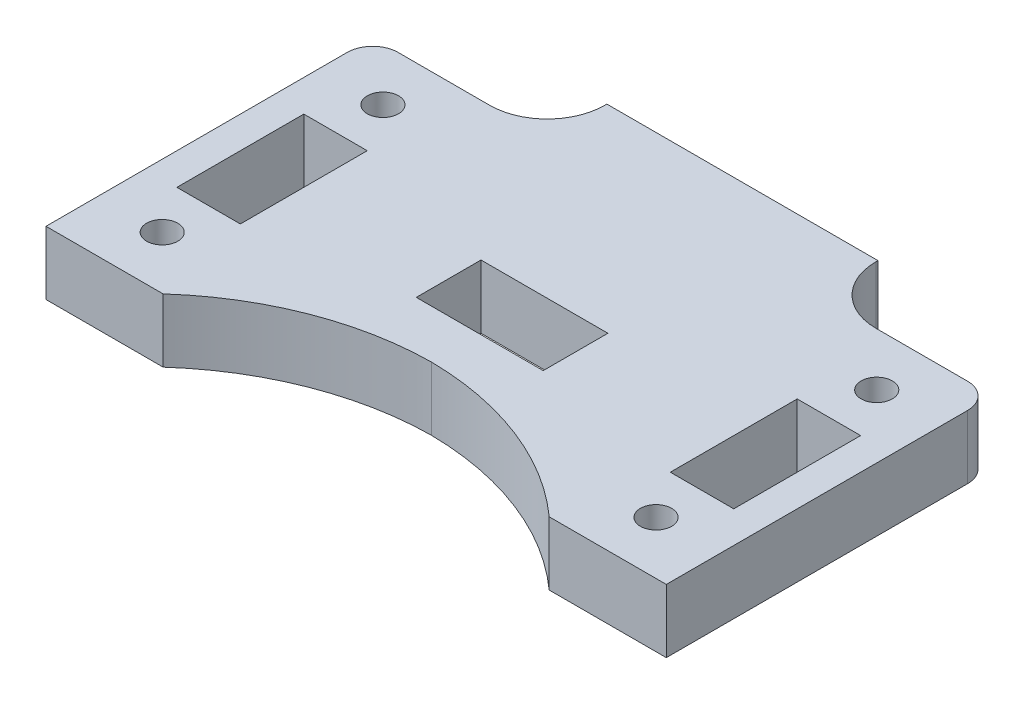
ISO-10303-21;
HEADER;
FILE_DESCRIPTION(('STEP AP214'),'2;1');
FILE_NAME('part.step','',(''),(''),'','','');
FILE_SCHEMA(('AUTOMOTIVE_DESIGN { 1 0 10303 214 1 1 1 1 }'));
ENDSEC;
DATA;
#1=APPLICATION_CONTEXT('core data for automotive mechanical design processes');
#2=APPLICATION_PROTOCOL_DEFINITION('international standard','automotive_design',2000,#1);
#3=PRODUCT_CONTEXT('',#1,'mechanical');
#4=PRODUCT('Part','Part','',(#3));
#5=PRODUCT_RELATED_PRODUCT_CATEGORY('part','',(#4));
#6=PRODUCT_DEFINITION_FORMATION('','',#4);
#7=PRODUCT_DEFINITION_CONTEXT('part definition',#1,'design');
#8=PRODUCT_DEFINITION('design','',#6,#7);
#9=PRODUCT_DEFINITION_SHAPE('','',#8);
#10=(LENGTH_UNIT() NAMED_UNIT(*) SI_UNIT(.MILLI.,.METRE.));
#11=(NAMED_UNIT(*) PLANE_ANGLE_UNIT() SI_UNIT($,.RADIAN.));
#12=(NAMED_UNIT(*) SI_UNIT($,.STERADIAN.) SOLID_ANGLE_UNIT());
#13=UNCERTAINTY_MEASURE_WITH_UNIT(LENGTH_MEASURE(1.E-05),#10,'distance_accuracy_value','');
#14=(GEOMETRIC_REPRESENTATION_CONTEXT(3) GLOBAL_UNCERTAINTY_ASSIGNED_CONTEXT((#13)) GLOBAL_UNIT_ASSIGNED_CONTEXT((#10,
#11,#12)) REPRESENTATION_CONTEXT('',''));
#15=CARTESIAN_POINT('',(0.,0.,0.));
#16=DIRECTION('',(0.,0.,1.));
#17=DIRECTION('',(1.,0.,0.));
#18=AXIS2_PLACEMENT_3D('',#15,#16,#17);
#19=CARTESIAN_POINT('',(19.3199465037168,6.35,-22.0955268424819));
#20=DIRECTION('',(0.,-1.,0.));
#21=DIRECTION('',(0.,0.,-1.));
#22=AXIS2_PLACEMENT_3D('',#19,#20,#21);
#23=PLANE('',#22);
#24=DIRECTION('',(0.,0.,1.));
#25=VECTOR('',#24,1.);
#26=CARTESIAN_POINT('',(21.5138,6.35,-6.28155672872584));
#27=LINE('',#26,#25);
#28=CARTESIAN_POINT('',(21.5138,6.35,-6.28155672872584));
#29=VERTEX_POINT('',#28);
#30=CARTESIAN_POINT('',(21.5138,6.35,6.41844327127416));
#31=VERTEX_POINT('',#30);
#32=EDGE_CURVE('E215',#29,#31,#27,.T.);
#33=ORIENTED_EDGE('',*,*,#32,.F.);
#34=DIRECTION('',(-1.,0.,0.));
#35=VECTOR('',#34,1.);
#36=CARTESIAN_POINT('',(21.5138,6.35,-6.28155672872584));
#37=LINE('',#36,#35);
#38=CARTESIAN_POINT('',(27.8638,6.35,-6.28155672872584));
#39=VERTEX_POINT('',#38);
#40=EDGE_CURVE('E241',#39,#29,#37,.T.);
#41=ORIENTED_EDGE('',*,*,#40,.F.);
#42=DIRECTION('',(0.,0.,-1.));
#43=VECTOR('',#42,1.);
#44=CARTESIAN_POINT('',(27.8638,6.35,-6.28155672872584));
#45=LINE('',#44,#43);
#46=CARTESIAN_POINT('',(27.8638,6.35,6.41844327127416));
#47=VERTEX_POINT('',#46);
#48=EDGE_CURVE('E239',#47,#39,#45,.T.);
#49=ORIENTED_EDGE('',*,*,#48,.F.);
#50=DIRECTION('',(1.,0.,0.));
#51=VECTOR('',#50,1.);
#52=CARTESIAN_POINT('',(21.5138,6.35,6.41844327127416));
#53=LINE('',#52,#51);
#54=EDGE_CURVE('E225',#31,#47,#53,.T.);
#55=ORIENTED_EDGE('',*,*,#54,.F.);
#56=EDGE_LOOP('',(#33,#41,#49,#55));
#57=FACE_BOUND('',#56,.T.);
#58=CARTESIAN_POINT('',(-24.7096471512574,6.35,11.0440567287259));
#59=DIRECTION('',(0.,1.,0.));
#60=DIRECTION('',(0.,0.,-1.));
#61=AXIS2_PLACEMENT_3D('',#58,#59,#60);
#62=CIRCLE('',#61,1.5621);
#63=CARTESIAN_POINT('',(-24.7096471512574,6.35,9.48195672872585));
#64=VERTEX_POINT('',#63);
#65=EDGE_CURVE('E261',#64,#64,#62,.T.);
#66=ORIENTED_EDGE('',*,*,#65,.F.);
#67=EDGE_LOOP('',(#66));
#68=FACE_BOUND('',#67,.T.);
#69=DIRECTION('',(0.,0.,-1.));
#70=VECTOR('',#69,1.);
#71=CARTESIAN_POINT('',(-21.5138,6.35,-6.28155672872584));
#72=LINE('',#71,#70);
#73=CARTESIAN_POINT('',(-21.5138,6.35,6.41844327127416));
#74=VERTEX_POINT('',#73);
#75=CARTESIAN_POINT('',(-21.5138,6.35,-6.28155672872584));
#76=VERTEX_POINT('',#75);
#77=EDGE_CURVE('E268',#74,#76,#72,.T.);
#78=ORIENTED_EDGE('',*,*,#77,.F.);
#79=DIRECTION('',(1.,0.,0.));
#80=VECTOR('',#79,1.);
#81=CARTESIAN_POINT('',(-21.5138,6.35,6.41844327127416));
#82=LINE('',#81,#80);
#83=CARTESIAN_POINT('',(-27.8638,6.35,6.41844327127416));
#84=VERTEX_POINT('',#83);
#85=EDGE_CURVE('E276',#84,#74,#82,.T.);
#86=ORIENTED_EDGE('',*,*,#85,.F.);
#87=DIRECTION('',(0.,0.,1.));
#88=VECTOR('',#87,1.);
#89=CARTESIAN_POINT('',(-27.8638,6.35,-6.28155672872584));
#90=LINE('',#89,#88);
#91=CARTESIAN_POINT('',(-27.8638,6.35,-6.28155672872584));
#92=VERTEX_POINT('',#91);
#93=EDGE_CURVE('E273',#92,#84,#90,.T.);
#94=ORIENTED_EDGE('',*,*,#93,.F.);
#95=DIRECTION('',(-1.,0.,0.));
#96=VECTOR('',#95,1.);
#97=CARTESIAN_POINT('',(-21.5138,6.35,-6.28155672872584));
#98=LINE('',#97,#96);
#99=EDGE_CURVE('E270',#76,#92,#98,.T.);
#100=ORIENTED_EDGE('',*,*,#99,.F.);
#101=EDGE_LOOP('',(#78,#86,#94,#100));
#102=FACE_BOUND('',#101,.T.);
#103=DIRECTION('',(-1.,0.,0.));
#104=VECTOR('',#103,1.);
#105=CARTESIAN_POINT('',(-19.3199465037169,6.35,-16.3436479865828));
#106=LINE('',#105,#104);
#107=CARTESIAN_POINT('',(-19.3199465037169,6.35,-16.3436479865828));
#108=VERTEX_POINT('',#107);
#109=CARTESIAN_POINT('',(-28.4988,6.35,-16.3436479865828));
#110=VERTEX_POINT('',#109);
#111=EDGE_CURVE('E347',#108,#110,#106,.T.);
#112=ORIENTED_EDGE('',*,*,#111,.T.);
#113=CARTESIAN_POINT('',(-28.4988,6.35,-13.8036479865828));
#114=DIRECTION('',(0.,-1.,0.));
#115=DIRECTION('',(0.,0.,-1.));
#116=AXIS2_PLACEMENT_3D('',#113,#114,#115);
#117=CIRCLE('',#116,2.54);
#118=CARTESIAN_POINT('',(-31.0388,6.35,-13.8036479865828));
#119=VERTEX_POINT('',#118);
#120=EDGE_CURVE('E427',#110,#119,#117,.F.);
#121=ORIENTED_EDGE('',*,*,#120,.T.);
#122=DIRECTION('',(0.,0.,1.));
#123=VECTOR('',#122,1.);
#124=CARTESIAN_POINT('',(-31.0388,6.35,16.3436479865828));
#125=LINE('',#124,#123);
#126=CARTESIAN_POINT('',(-31.0388,6.35,16.3436479865828));
#127=VERTEX_POINT('',#126);
#128=EDGE_CURVE('E350',#119,#127,#125,.T.);
#129=ORIENTED_EDGE('',*,*,#128,.T.);
#130=DIRECTION('',(1.,0.,0.));
#131=VECTOR('',#130,1.);
#132=CARTESIAN_POINT('',(-29.68469832055,6.35,16.3436479865828));
#133=LINE('',#132,#131);
#134=CARTESIAN_POINT('',(-19.3199465037169,6.35,16.3436479865828));
#135=VERTEX_POINT('',#134);
#136=EDGE_CURVE('E352',#127,#135,#133,.T.);
#137=ORIENTED_EDGE('',*,*,#136,.T.);
#138=CARTESIAN_POINT('',(0.319996397646252,6.35,38.2203808826539));
#139=DIRECTION('',(0.,-1.,0.));
#140=DIRECTION('',(0.,0.,1.));
#141=AXIS2_PLACEMENT_3D('',#138,#139,#140);
#142=CIRCLE('',#141,29.3992993007459);
#143=CARTESIAN_POINT('',(0.,6.35,8.82282313238603));
#144=VERTEX_POINT('',#143);
#145=EDGE_CURVE('E354',#135,#144,#142,.T.);
#146=ORIENTED_EDGE('',*,*,#145,.T.);
#147=CARTESIAN_POINT('',(-0.319996397646185,6.35,38.2203808826539));
#148=DIRECTION('',(0.,-1.,0.));
#149=DIRECTION('',(0.,0.,-1.));
#150=AXIS2_PLACEMENT_3D('',#147,#148,#149);
#151=CIRCLE('',#150,29.3992993007459);
#152=CARTESIAN_POINT('',(19.3199465037169,6.35,16.3436479865828));
#153=VERTEX_POINT('',#152);
#154=EDGE_CURVE('E356',#144,#153,#151,.T.);
#155=ORIENTED_EDGE('',*,*,#154,.T.);
#156=DIRECTION('',(1.,0.,0.));
#157=VECTOR('',#156,1.);
#158=CARTESIAN_POINT('',(19.3199465037169,6.35,16.3436479865828));
#159=LINE('',#158,#157);
#160=CARTESIAN_POINT('',(31.0388000000002,6.35,16.3436479865829));
#161=VERTEX_POINT('',#160);
#162=EDGE_CURVE('E330',#153,#161,#159,.T.);
#163=ORIENTED_EDGE('',*,*,#162,.T.);
#164=DIRECTION('',(0.,0.,-1.));
#165=VECTOR('',#164,1.);
#166=CARTESIAN_POINT('',(31.0388000000002,6.35,16.3436479865829));
#167=LINE('',#166,#165);
#168=CARTESIAN_POINT('',(31.0388000000002,6.35,-13.8036479865828));
#169=VERTEX_POINT('',#168);
#170=EDGE_CURVE('E332',#161,#169,#167,.T.);
#171=ORIENTED_EDGE('',*,*,#170,.T.);
#172=CARTESIAN_POINT('',(28.4988000000002,6.35,-13.8036479865828));
#173=DIRECTION('',(0.,-1.,0.));
#174=DIRECTION('',(0.,0.,-1.));
#175=AXIS2_PLACEMENT_3D('',#172,#173,#174);
#176=CIRCLE('',#175,2.54);
#177=CARTESIAN_POINT('',(28.4988000000002,6.35,-16.3436479865828));
#178=VERTEX_POINT('',#177);
#179=EDGE_CURVE('E48',#169,#178,#176,.F.);
#180=ORIENTED_EDGE('',*,*,#179,.T.);
#181=DIRECTION('',(-1.,0.,0.));
#182=VECTOR('',#181,1.);
#183=CARTESIAN_POINT('',(19.3199465037168,6.35,-16.3436479865828));
#184=LINE('',#183,#182);
#185=CARTESIAN_POINT('',(19.3199465037168,6.35,-16.3436479865828));
#186=VERTEX_POINT('',#185);
#187=EDGE_CURVE('E335',#178,#186,#184,.T.);
#188=ORIENTED_EDGE('',*,*,#187,.T.);
#189=CARTESIAN_POINT('',(19.3199465037168,6.35,-22.0955268424819));
#190=DIRECTION('',(0.,-1.,0.));
#191=DIRECTION('',(0.,0.,-1.));
#192=AXIS2_PLACEMENT_3D('',#189,#190,#191);
#193=CIRCLE('',#192,5.75187885589908);
#194=CARTESIAN_POINT('',(13.5680676478177,6.35,-22.0955268424819));
#195=VERTEX_POINT('',#194);
#196=EDGE_CURVE('E337',#186,#195,#193,.T.);
#197=ORIENTED_EDGE('',*,*,#196,.T.);
#198=DIRECTION('',(0.,0.,-1.));
#199=VECTOR('',#198,1.);
#200=CARTESIAN_POINT('',(13.5680676478177,6.35,-22.0955268424819));
#201=LINE('',#200,#199);
#202=CARTESIAN_POINT('',(13.5680676478177,6.35,-22.3126479865828));
#203=VERTEX_POINT('',#202);
#204=EDGE_CURVE('E339',#195,#203,#201,.T.);
#205=ORIENTED_EDGE('',*,*,#204,.T.);
#206=DIRECTION('',(-1.,0.,0.));
#207=VECTOR('',#206,1.);
#208=CARTESIAN_POINT('',(13.5680676478177,6.35,-22.3126479865828));
#209=LINE('',#208,#207);
#210=CARTESIAN_POINT('',(-13.5680676478178,6.35,-22.3126479865828));
#211=VERTEX_POINT('',#210);
#212=EDGE_CURVE('E341',#203,#211,#209,.T.);
#213=ORIENTED_EDGE('',*,*,#212,.T.);
#214=DIRECTION('',(0.,0.,1.));
#215=VECTOR('',#214,1.);
#216=CARTESIAN_POINT('',(-13.5680676478178,6.35,-22.3126479865828));
#217=LINE('',#216,#215);
#218=CARTESIAN_POINT('',(-13.5680676478178,6.35,-22.0955268424819));
#219=VERTEX_POINT('',#218);
#220=EDGE_CURVE('E343',#211,#219,#217,.T.);
#221=ORIENTED_EDGE('',*,*,#220,.T.);
#222=CARTESIAN_POINT('',(-19.3199465037169,6.35,-22.0955268424819));
#223=DIRECTION('',(0.,-1.,0.));
#224=DIRECTION('',(0.,0.,1.));
#225=AXIS2_PLACEMENT_3D('',#222,#223,#224);
#226=CIRCLE('',#225,5.75187885589908);
#227=EDGE_CURVE('E345',#219,#108,#226,.T.);
#228=ORIENTED_EDGE('',*,*,#227,.T.);
#229=EDGE_LOOP('',(#112,#121,#129,#137,#146,#155,#163,#171,#180,#188,#197,#205,#213,#221,#228));
#230=FACE_BOUND('',#229,.T.);
#231=DIRECTION('',(0.,0.,1.));
#232=VECTOR('',#231,1.);
#233=CARTESIAN_POINT('',(-6.35,6.35,-2.50064798658281));
#234=LINE('',#233,#232);
#235=CARTESIAN_POINT('',(-6.35,6.35,-2.50064798658281));
#236=VERTEX_POINT('',#235);
#237=CARTESIAN_POINT('',(-6.35,6.35,3.97635201341719));
#238=VERTEX_POINT('',#237);
#239=EDGE_CURVE('E299',#236,#238,#234,.T.);
#240=ORIENTED_EDGE('',*,*,#239,.F.);
#241=DIRECTION('',(-1.,0.,0.));
#242=VECTOR('',#241,1.);
#243=CARTESIAN_POINT('',(-6.35,6.35,-2.50064798658281));
#244=LINE('',#243,#242);
#245=CARTESIAN_POINT('',(6.35,6.35,-2.50064798658281));
#246=VERTEX_POINT('',#245);
#247=EDGE_CURVE('E307',#246,#236,#244,.T.);
#248=ORIENTED_EDGE('',*,*,#247,.F.);
#249=DIRECTION('',(0.,0.,-1.));
#250=VECTOR('',#249,1.);
#251=CARTESIAN_POINT('',(6.35,6.35,-2.50064798658281));
#252=LINE('',#251,#250);
#253=CARTESIAN_POINT('',(6.35,6.35,3.97635201341719));
#254=VERTEX_POINT('',#253);
#255=EDGE_CURVE('E304',#254,#246,#252,.T.);
#256=ORIENTED_EDGE('',*,*,#255,.F.);
#257=DIRECTION('',(1.,0.,0.));
#258=VECTOR('',#257,1.);
#259=CARTESIAN_POINT('',(-6.35,6.35,3.97635201341719));
#260=LINE('',#259,#258);
#261=EDGE_CURVE('E301',#238,#254,#260,.T.);
#262=ORIENTED_EDGE('',*,*,#261,.F.);
#263=EDGE_LOOP('',(#240,#248,#256,#262));
#264=FACE_BOUND('',#263,.T.);
#265=CARTESIAN_POINT('',(-24.7096471512574,6.35,-11.0440567287258));
#266=DIRECTION('',(0.,1.,0.));
#267=DIRECTION('',(0.,0.,1.));
#268=AXIS2_PLACEMENT_3D('',#265,#266,#267);
#269=CIRCLE('',#268,1.5621);
#270=CARTESIAN_POINT('',(-24.7096471512574,6.35,-9.48195672872584));
#271=VERTEX_POINT('',#270);
#272=EDGE_CURVE('E264',#271,#271,#269,.T.);
#273=ORIENTED_EDGE('',*,*,#272,.F.);
#274=EDGE_LOOP('',(#273));
#275=FACE_BOUND('',#274,.T.);
#276=CARTESIAN_POINT('',(24.7096471512574,6.35,-11.0440567287258));
#277=DIRECTION('',(0.,1.,0.));
#278=DIRECTION('',(0.,0.,-1.));
#279=AXIS2_PLACEMENT_3D('',#276,#277,#278);
#280=CIRCLE('',#279,1.5621);
#281=CARTESIAN_POINT('',(24.7096471512574,6.35,-12.6061567287258));
#282=VERTEX_POINT('',#281);
#283=EDGE_CURVE('E233',#282,#282,#280,.T.);
#284=ORIENTED_EDGE('',*,*,#283,.F.);
#285=EDGE_LOOP('',(#284));
#286=FACE_BOUND('',#285,.T.);
#287=CARTESIAN_POINT('',(24.7096471512574,6.35,11.0440567287259));
#288=DIRECTION('',(0.,1.,0.));
#289=DIRECTION('',(0.,0.,1.));
#290=AXIS2_PLACEMENT_3D('',#287,#288,#289);
#291=CIRCLE('',#290,1.5621);
#292=CARTESIAN_POINT('',(24.7096471512574,6.35,12.6061567287259));
#293=VERTEX_POINT('',#292);
#294=EDGE_CURVE('E248',#293,#293,#291,.T.);
#295=ORIENTED_EDGE('',*,*,#294,.F.);
#296=EDGE_LOOP('',(#295));
#297=FACE_BOUND('',#296,.T.);
#298=ADVANCED_FACE('F33',(#57,#68,#102,#230,#264,#275,#286,#297),#23,.F.);
#299=CARTESIAN_POINT('',(19.3199465037168,0.,-22.0955268424819));
#300=DIRECTION('',(0.,-1.,0.));
#301=DIRECTION('',(0.,0.,-1.));
#302=AXIS2_PLACEMENT_3D('',#299,#300,#301);
#303=PLANE('',#302);
#304=CARTESIAN_POINT('',(-24.7096471512574,0.,11.0440567287259));
#305=DIRECTION('',(0.,-1.,0.));
#306=DIRECTION('',(0.,0.,-1.));
#307=AXIS2_PLACEMENT_3D('',#304,#305,#306);
#308=CIRCLE('',#307,3.46710000000001);
#309=CARTESIAN_POINT('',(-24.7096471512574,0.,7.57695672872585));
#310=VERTEX_POINT('',#309);
#311=EDGE_CURVE('E442',#310,#310,#308,.F.);
#312=ORIENTED_EDGE('',*,*,#311,.T.);
#313=EDGE_LOOP('',(#312));
#314=FACE_BOUND('',#313,.T.);
#315=CARTESIAN_POINT('',(24.7096471512574,0.,11.0440567287259));
#316=DIRECTION('',(0.,-1.,0.));
#317=DIRECTION('',(0.,0.,-1.));
#318=AXIS2_PLACEMENT_3D('',#315,#316,#317);
#319=CIRCLE('',#318,3.46709999999998);
#320=CARTESIAN_POINT('',(24.7096471512574,0.,7.57695672872587));
#321=VERTEX_POINT('',#320);
#322=EDGE_CURVE('E439',#321,#321,#319,.F.);
#323=ORIENTED_EDGE('',*,*,#322,.T.);
#324=EDGE_LOOP('',(#323));
#325=FACE_BOUND('',#324,.T.);
#326=CARTESIAN_POINT('',(24.7096471512574,0.,-11.0440567287258));
#327=DIRECTION('',(0.,-1.,0.));
#328=DIRECTION('',(0.,0.,-1.));
#329=AXIS2_PLACEMENT_3D('',#326,#327,#328);
#330=CIRCLE('',#329,3.46709999999998);
#331=CARTESIAN_POINT('',(24.7096471512574,0.,-14.5111567287258));
#332=VERTEX_POINT('',#331);
#333=EDGE_CURVE('E436',#332,#332,#330,.F.);
#334=ORIENTED_EDGE('',*,*,#333,.T.);
#335=EDGE_LOOP('',(#334));
#336=FACE_BOUND('',#335,.T.);
#337=CARTESIAN_POINT('',(-24.7096471512574,0.,-11.0440567287258));
#338=DIRECTION('',(0.,-1.,0.));
#339=DIRECTION('',(0.,0.,-1.));
#340=AXIS2_PLACEMENT_3D('',#337,#338,#339);
#341=CIRCLE('',#340,3.46710000000001);
#342=CARTESIAN_POINT('',(-24.7096471512574,0.,-14.5111567287258));
#343=VERTEX_POINT('',#342);
#344=EDGE_CURVE('E433',#343,#343,#341,.F.);
#345=ORIENTED_EDGE('',*,*,#344,.T.);
#346=EDGE_LOOP('',(#345));
#347=FACE_BOUND('',#346,.T.);
#348=DIRECTION('',(-1.,0.,0.));
#349=VECTOR('',#348,1.);
#350=CARTESIAN_POINT('',(21.5138,0.,-6.28155672872584));
#351=LINE('',#350,#349);
#352=CARTESIAN_POINT('',(27.8638,0.,-6.28155672872584));
#353=VERTEX_POINT('',#352);
#354=CARTESIAN_POINT('',(21.5138,0.,-6.28155672872584));
#355=VERTEX_POINT('',#354);
#356=EDGE_CURVE('E226',#353,#355,#351,.T.);
#357=ORIENTED_EDGE('',*,*,#356,.T.);
#358=DIRECTION('',(0.,0.,1.));
#359=VECTOR('',#358,1.);
#360=CARTESIAN_POINT('',(21.5138,0.,-6.28155672872584));
#361=LINE('',#360,#359);
#362=CARTESIAN_POINT('',(21.5138,0.,6.41844327127416));
#363=VERTEX_POINT('',#362);
#364=EDGE_CURVE('E246',#355,#363,#361,.T.);
#365=ORIENTED_EDGE('',*,*,#364,.T.);
#366=DIRECTION('',(1.,0.,0.));
#367=VECTOR('',#366,1.);
#368=CARTESIAN_POINT('',(21.5138,0.,6.41844327127416));
#369=LINE('',#368,#367);
#370=CARTESIAN_POINT('',(27.8638,0.,6.41844327127416));
#371=VERTEX_POINT('',#370);
#372=EDGE_CURVE('E232',#363,#371,#369,.T.);
#373=ORIENTED_EDGE('',*,*,#372,.T.);
#374=DIRECTION('',(0.,0.,-1.));
#375=VECTOR('',#374,1.);
#376=CARTESIAN_POINT('',(27.8638,0.,-6.28155672872584));
#377=LINE('',#376,#375);
#378=EDGE_CURVE('E250',#371,#353,#377,.T.);
#379=ORIENTED_EDGE('',*,*,#378,.T.);
#380=EDGE_LOOP('',(#357,#365,#373,#379));
#381=FACE_BOUND('',#380,.T.);
#382=DIRECTION('',(1.,0.,0.));
#383=VECTOR('',#382,1.);
#384=CARTESIAN_POINT('',(-21.5138,0.,6.41844327127416));
#385=LINE('',#384,#383);
#386=CARTESIAN_POINT('',(-27.8638,0.,6.41844327127416));
#387=VERTEX_POINT('',#386);
#388=CARTESIAN_POINT('',(-21.5138,0.,6.41844327127416));
#389=VERTEX_POINT('',#388);
#390=EDGE_CURVE('E271',#387,#389,#385,.T.);
#391=ORIENTED_EDGE('',*,*,#390,.T.);
#392=DIRECTION('',(0.,0.,-1.));
#393=VECTOR('',#392,1.);
#394=CARTESIAN_POINT('',(-21.5138,0.,-6.28155672872584));
#395=LINE('',#394,#393);
#396=CARTESIAN_POINT('',(-21.5138,0.,-6.28155672872584));
#397=VERTEX_POINT('',#396);
#398=EDGE_CURVE('E267',#389,#397,#395,.T.);
#399=ORIENTED_EDGE('',*,*,#398,.T.);
#400=DIRECTION('',(-1.,0.,0.));
#401=VECTOR('',#400,1.);
#402=CARTESIAN_POINT('',(-21.5138,0.,-6.28155672872584));
#403=LINE('',#402,#401);
#404=CARTESIAN_POINT('',(-27.8638,0.,-6.28155672872584));
#405=VERTEX_POINT('',#404);
#406=EDGE_CURVE('E281',#397,#405,#403,.T.);
#407=ORIENTED_EDGE('',*,*,#406,.T.);
#408=DIRECTION('',(0.,0.,1.));
#409=VECTOR('',#408,1.);
#410=CARTESIAN_POINT('',(-27.8638,0.,-6.28155672872584));
#411=LINE('',#410,#409);
#412=EDGE_CURVE('E284',#405,#387,#411,.T.);
#413=ORIENTED_EDGE('',*,*,#412,.T.);
#414=EDGE_LOOP('',(#391,#399,#407,#413));
#415=FACE_BOUND('',#414,.T.);
#416=DIRECTION('',(0.,0.,1.));
#417=VECTOR('',#416,1.);
#418=CARTESIAN_POINT('',(-31.0388,0.,16.3436479865828));
#419=LINE('',#418,#417);
#420=CARTESIAN_POINT('',(-31.0388,0.,-13.8036479865828));
#421=VERTEX_POINT('',#420);
#422=CARTESIAN_POINT('',(-31.0388,0.,16.3436479865828));
#423=VERTEX_POINT('',#422);
#424=EDGE_CURVE('E377',#421,#423,#419,.T.);
#425=ORIENTED_EDGE('',*,*,#424,.F.);
#426=CARTESIAN_POINT('',(-28.4988,0.,-13.8036479865828));
#427=DIRECTION('',(0.,-1.,0.));
#428=DIRECTION('',(0.,0.,-1.));
#429=AXIS2_PLACEMENT_3D('',#426,#427,#428);
#430=CIRCLE('',#429,2.54);
#431=CARTESIAN_POINT('',(-28.4988,0.,-16.3436479865828));
#432=VERTEX_POINT('',#431);
#433=EDGE_CURVE('E422',#421,#432,#430,.T.);
#434=ORIENTED_EDGE('',*,*,#433,.T.);
#435=DIRECTION('',(-1.,0.,0.));
#436=VECTOR('',#435,1.);
#437=CARTESIAN_POINT('',(-19.3199465037169,0.,-16.3436479865828));
#438=LINE('',#437,#436);
#439=CARTESIAN_POINT('',(-19.3199465037169,0.,-16.3436479865828));
#440=VERTEX_POINT('',#439);
#441=EDGE_CURVE('E374',#440,#432,#438,.T.);
#442=ORIENTED_EDGE('',*,*,#441,.F.);
#443=CARTESIAN_POINT('',(-19.3199465037169,0.,-22.0955268424819));
#444=DIRECTION('',(0.,-1.,0.));
#445=DIRECTION('',(0.,0.,1.));
#446=AXIS2_PLACEMENT_3D('',#443,#444,#445);
#447=CIRCLE('',#446,5.75187885589908);
#448=CARTESIAN_POINT('',(-13.5680676478178,0.,-22.0955268424819));
#449=VERTEX_POINT('',#448);
#450=EDGE_CURVE('E372',#449,#440,#447,.T.);
#451=ORIENTED_EDGE('',*,*,#450,.F.);
#452=DIRECTION('',(0.,0.,1.));
#453=VECTOR('',#452,1.);
#454=CARTESIAN_POINT('',(-13.5680676478178,0.,-22.3126479865828));
#455=LINE('',#454,#453);
#456=CARTESIAN_POINT('',(-13.5680676478178,0.,-22.3126479865828));
#457=VERTEX_POINT('',#456);
#458=EDGE_CURVE('E370',#457,#449,#455,.T.);
#459=ORIENTED_EDGE('',*,*,#458,.F.);
#460=DIRECTION('',(-1.,0.,0.));
#461=VECTOR('',#460,1.);
#462=CARTESIAN_POINT('',(13.5680676478177,0.,-22.3126479865828));
#463=LINE('',#462,#461);
#464=CARTESIAN_POINT('',(13.5680676478177,0.,-22.3126479865828));
#465=VERTEX_POINT('',#464);
#466=EDGE_CURVE('E368',#465,#457,#463,.T.);
#467=ORIENTED_EDGE('',*,*,#466,.F.);
#468=DIRECTION('',(0.,0.,-1.));
#469=VECTOR('',#468,1.);
#470=CARTESIAN_POINT('',(13.5680676478177,0.,-22.0955268424819));
#471=LINE('',#470,#469);
#472=CARTESIAN_POINT('',(13.5680676478177,0.,-22.0955268424819));
#473=VERTEX_POINT('',#472);
#474=EDGE_CURVE('E366',#473,#465,#471,.T.);
#475=ORIENTED_EDGE('',*,*,#474,.F.);
#476=CARTESIAN_POINT('',(19.3199465037168,0.,-22.0955268424819));
#477=DIRECTION('',(0.,-1.,0.));
#478=DIRECTION('',(0.,0.,-1.));
#479=AXIS2_PLACEMENT_3D('',#476,#477,#478);
#480=CIRCLE('',#479,5.75187885589908);
#481=CARTESIAN_POINT('',(19.3199465037168,0.,-16.3436479865828));
#482=VERTEX_POINT('',#481);
#483=EDGE_CURVE('E364',#482,#473,#480,.T.);
#484=ORIENTED_EDGE('',*,*,#483,.F.);
#485=DIRECTION('',(-1.,0.,0.));
#486=VECTOR('',#485,1.);
#487=CARTESIAN_POINT('',(19.3199465037168,0.,-16.3436479865828));
#488=LINE('',#487,#486);
#489=CARTESIAN_POINT('',(28.4988000000002,0.,-16.3436479865828));
#490=VERTEX_POINT('',#489);
#491=EDGE_CURVE('E362',#490,#482,#488,.T.);
#492=ORIENTED_EDGE('',*,*,#491,.F.);
#493=CARTESIAN_POINT('',(28.4988000000002,0.,-13.8036479865828));
#494=DIRECTION('',(0.,-1.,0.));
#495=DIRECTION('',(0.,0.,-1.));
#496=AXIS2_PLACEMENT_3D('',#493,#494,#495);
#497=CIRCLE('',#496,2.54);
#498=CARTESIAN_POINT('',(31.0388000000002,0.,-13.8036479865828));
#499=VERTEX_POINT('',#498);
#500=EDGE_CURVE('E420',#490,#499,#497,.T.);
#501=ORIENTED_EDGE('',*,*,#500,.T.);
#502=DIRECTION('',(0.,0.,-1.));
#503=VECTOR('',#502,1.);
#504=CARTESIAN_POINT('',(31.0388000000002,0.,16.3436479865829));
#505=LINE('',#504,#503);
#506=CARTESIAN_POINT('',(31.0388000000002,0.,16.3436479865829));
#507=VERTEX_POINT('',#506);
#508=EDGE_CURVE('E360',#507,#499,#505,.T.);
#509=ORIENTED_EDGE('',*,*,#508,.F.);
#510=DIRECTION('',(1.,0.,0.));
#511=VECTOR('',#510,1.);
#512=CARTESIAN_POINT('',(29.68469832055,0.,16.3436479865828));
#513=LINE('',#512,#511);
#514=CARTESIAN_POINT('',(19.3199465037169,0.,16.3436479865828));
#515=VERTEX_POINT('',#514);
#516=EDGE_CURVE('E329',#515,#507,#513,.T.);
#517=ORIENTED_EDGE('',*,*,#516,.F.);
#518=CARTESIAN_POINT('',(-0.319996397646185,0.,38.2203808826539));
#519=DIRECTION('',(0.,-1.,0.));
#520=DIRECTION('',(0.,0.,-1.));
#521=AXIS2_PLACEMENT_3D('',#518,#519,#520);
#522=CIRCLE('',#521,29.3992993007459);
#523=CARTESIAN_POINT('',(0.,0.,8.82282313238603));
#524=VERTEX_POINT('',#523);
#525=EDGE_CURVE('E333',#524,#515,#522,.T.);
#526=ORIENTED_EDGE('',*,*,#525,.F.);
#527=CARTESIAN_POINT('',(0.319996397646252,0.,38.2203808826539));
#528=DIRECTION('',(0.,-1.,0.));
#529=DIRECTION('',(0.,0.,1.));
#530=AXIS2_PLACEMENT_3D('',#527,#528,#529);
#531=CIRCLE('',#530,29.3992993007459);
#532=CARTESIAN_POINT('',(-19.3199465037169,0.,16.3436479865828));
#533=VERTEX_POINT('',#532);
#534=EDGE_CURVE('E381',#533,#524,#531,.T.);
#535=ORIENTED_EDGE('',*,*,#534,.F.);
#536=DIRECTION('',(1.,0.,0.));
#537=VECTOR('',#536,1.);
#538=CARTESIAN_POINT('',(-29.68469832055,0.,16.3436479865828));
#539=LINE('',#538,#537);
#540=EDGE_CURVE('E379',#423,#533,#539,.T.);
#541=ORIENTED_EDGE('',*,*,#540,.F.);
#542=EDGE_LOOP('',(#425,#434,#442,#451,#459,#467,#475,#484,#492,#501,#509,#517,#526,#535,#541));
#543=FACE_BOUND('',#542,.T.);
#544=DIRECTION('',(-1.,0.,0.));
#545=VECTOR('',#544,1.);
#546=CARTESIAN_POINT('',(-6.35,0.,-2.50064798658281));
#547=LINE('',#546,#545);
#548=CARTESIAN_POINT('',(6.35,0.,-2.50064798658281));
#549=VERTEX_POINT('',#548);
#550=CARTESIAN_POINT('',(-6.34999999999999,0.,-2.50064798658281));
#551=VERTEX_POINT('',#550);
#552=EDGE_CURVE('E302',#549,#551,#547,.T.);
#553=ORIENTED_EDGE('',*,*,#552,.T.);
#554=DIRECTION('',(0.,0.,1.));
#555=VECTOR('',#554,1.);
#556=CARTESIAN_POINT('',(-6.35,0.,-2.50064798658281));
#557=LINE('',#556,#555);
#558=CARTESIAN_POINT('',(-6.35,0.,3.97635201341719));
#559=VERTEX_POINT('',#558);
#560=EDGE_CURVE('E298',#551,#559,#557,.T.);
#561=ORIENTED_EDGE('',*,*,#560,.T.);
#562=DIRECTION('',(1.,0.,0.));
#563=VECTOR('',#562,1.);
#564=CARTESIAN_POINT('',(-6.35,0.,3.97635201341719));
#565=LINE('',#564,#563);
#566=CARTESIAN_POINT('',(6.35,0.,3.97635201341719));
#567=VERTEX_POINT('',#566);
#568=EDGE_CURVE('E312',#559,#567,#565,.T.);
#569=ORIENTED_EDGE('',*,*,#568,.T.);
#570=DIRECTION('',(0.,0.,-1.));
#571=VECTOR('',#570,1.);
#572=CARTESIAN_POINT('',(6.35,0.,-2.50064798658281));
#573=LINE('',#572,#571);
#574=EDGE_CURVE('E315',#567,#549,#573,.T.);
#575=ORIENTED_EDGE('',*,*,#574,.T.);
#576=EDGE_LOOP('',(#553,#561,#569,#575));
#577=FACE_BOUND('',#576,.T.);
#578=ADVANCED_FACE('F462',(#314,#325,#336,#347,#381,#415,#543,#577),#303,.T.);
#579=CARTESIAN_POINT('',(29.68469832055,6.35,16.3436479865828));
#580=DIRECTION('',(0.,0.,-1.));
#581=DIRECTION('',(-1.,0.,0.));
#582=AXIS2_PLACEMENT_3D('',#579,#580,#581);
#583=PLANE('',#582);
#584=ORIENTED_EDGE('',*,*,#516,.T.);
#585=DIRECTION('',(0.,-1.,0.));
#586=VECTOR('',#585,1.);
#587=CARTESIAN_POINT('',(31.0388000000002,6.35,16.3436479865829));
#588=LINE('',#587,#586);
#589=EDGE_CURVE('E414',#161,#507,#588,.T.);
#590=ORIENTED_EDGE('',*,*,#589,.F.);
#591=ORIENTED_EDGE('',*,*,#162,.F.);
#592=DIRECTION('',(0.,-1.,0.));
#593=VECTOR('',#592,1.);
#594=CARTESIAN_POINT('',(19.3199465037169,6.35,16.3436479865828));
#595=LINE('',#594,#593);
#596=EDGE_CURVE('E358',#153,#515,#595,.T.);
#597=ORIENTED_EDGE('',*,*,#596,.T.);
#598=EDGE_LOOP('',(#584,#590,#591,#597));
#599=FACE_BOUND('',#598,.T.);
#600=ADVANCED_FACE('F465',(#599),#583,.F.);
#601=CARTESIAN_POINT('',(31.0388000000002,6.35,16.3436479865829));
#602=DIRECTION('',(-1.,0.,0.));
#603=DIRECTION('',(0.,0.,1.));
#604=AXIS2_PLACEMENT_3D('',#601,#602,#603);
#605=PLANE('',#604);
#606=ORIENTED_EDGE('',*,*,#508,.T.);
#607=DIRECTION('',(0.,-1.,0.));
#608=VECTOR('',#607,1.);
#609=CARTESIAN_POINT('',(31.0388000000002,6.35,-13.8036479865828));
#610=LINE('',#609,#608);
#611=EDGE_CURVE('E56',#499,#169,#610,.F.);
#612=ORIENTED_EDGE('',*,*,#611,.T.);
#613=ORIENTED_EDGE('',*,*,#170,.F.);
#614=ORIENTED_EDGE('',*,*,#589,.T.);
#615=EDGE_LOOP('',(#606,#612,#613,#614));
#616=FACE_BOUND('',#615,.T.);
#617=ADVANCED_FACE('F556',(#616),#605,.F.);
#618=CARTESIAN_POINT('',(19.3199465037168,6.35,-16.3436479865828));
#619=DIRECTION('',(0.,0.,1.));
#620=DIRECTION('',(1.,0.,0.));
#621=AXIS2_PLACEMENT_3D('',#618,#619,#620);
#622=PLANE('',#621);
#623=ORIENTED_EDGE('',*,*,#187,.F.);
#624=DIRECTION('',(0.,-1.,0.));
#625=VECTOR('',#624,1.);
#626=CARTESIAN_POINT('',(28.4988000000002,6.35,-16.3436479865828));
#627=LINE('',#626,#625);
#628=EDGE_CURVE('E429',#178,#490,#627,.T.);
#629=ORIENTED_EDGE('',*,*,#628,.T.);
#630=ORIENTED_EDGE('',*,*,#491,.T.);
#631=DIRECTION('',(0.,-1.,0.));
#632=VECTOR('',#631,1.);
#633=CARTESIAN_POINT('',(19.3199465037168,6.35,-16.3436479865828));
#634=LINE('',#633,#632);
#635=EDGE_CURVE('E411',#186,#482,#634,.T.);
#636=ORIENTED_EDGE('',*,*,#635,.F.);
#637=EDGE_LOOP('',(#623,#629,#630,#636));
#638=FACE_BOUND('',#637,.T.);
#639=ADVANCED_FACE('F552',(#638),#622,.F.);
#640=CARTESIAN_POINT('',(19.3199465037168,6.35,-22.0955268424819));
#641=DIRECTION('',(0.,-1.,0.));
#642=DIRECTION('',(0.,0.,-1.));
#643=AXIS2_PLACEMENT_3D('',#640,#641,#642);
#644=CYLINDRICAL_SURFACE('',#643,5.75187885589908);
#645=ORIENTED_EDGE('',*,*,#483,.T.);
#646=DIRECTION('',(0.,-1.,0.));
#647=VECTOR('',#646,1.);
#648=CARTESIAN_POINT('',(13.5680676478177,6.35,-22.0955268424819));
#649=LINE('',#648,#647);
#650=EDGE_CURVE('E408',#195,#473,#649,.T.);
#651=ORIENTED_EDGE('',*,*,#650,.F.);
#652=ORIENTED_EDGE('',*,*,#196,.F.);
#653=ORIENTED_EDGE('',*,*,#635,.T.);
#654=EDGE_LOOP('',(#645,#651,#652,#653));
#655=FACE_BOUND('',#654,.T.);
#656=ADVANCED_FACE('F548',(#655),#644,.F.);
#657=CARTESIAN_POINT('',(13.5680676478177,6.35,-22.0955268424819));
#658=DIRECTION('',(-1.,0.,0.));
#659=DIRECTION('',(0.,0.,1.));
#660=AXIS2_PLACEMENT_3D('',#657,#658,#659);
#661=PLANE('',#660);
#662=ORIENTED_EDGE('',*,*,#474,.T.);
#663=DIRECTION('',(0.,-1.,0.));
#664=VECTOR('',#663,1.);
#665=CARTESIAN_POINT('',(13.5680676478177,6.35,-22.3126479865828));
#666=LINE('',#665,#664);
#667=EDGE_CURVE('E405',#203,#465,#666,.T.);
#668=ORIENTED_EDGE('',*,*,#667,.F.);
#669=ORIENTED_EDGE('',*,*,#204,.F.);
#670=ORIENTED_EDGE('',*,*,#650,.T.);
#671=EDGE_LOOP('',(#662,#668,#669,#670));
#672=FACE_BOUND('',#671,.T.);
#673=ADVANCED_FACE('F544',(#672),#661,.F.);
#674=CARTESIAN_POINT('',(13.5680676478177,6.35,-22.3126479865828));
#675=DIRECTION('',(0.,0.,1.));
#676=DIRECTION('',(1.,0.,0.));
#677=AXIS2_PLACEMENT_3D('',#674,#675,#676);
#678=PLANE('',#677);
#679=ORIENTED_EDGE('',*,*,#466,.T.);
#680=DIRECTION('',(0.,-1.,0.));
#681=VECTOR('',#680,1.);
#682=CARTESIAN_POINT('',(-13.5680676478178,6.35,-22.3126479865828));
#683=LINE('',#682,#681);
#684=EDGE_CURVE('E402',#211,#457,#683,.T.);
#685=ORIENTED_EDGE('',*,*,#684,.F.);
#686=ORIENTED_EDGE('',*,*,#212,.F.);
#687=ORIENTED_EDGE('',*,*,#667,.T.);
#688=EDGE_LOOP('',(#679,#685,#686,#687));
#689=FACE_BOUND('',#688,.T.);
#690=ADVANCED_FACE('F540',(#689),#678,.F.);
#691=CARTESIAN_POINT('',(-13.5680676478178,6.35,-22.3126479865828));
#692=DIRECTION('',(1.,0.,0.));
#693=DIRECTION('',(0.,0.,-1.));
#694=AXIS2_PLACEMENT_3D('',#691,#692,#693);
#695=PLANE('',#694);
#696=ORIENTED_EDGE('',*,*,#458,.T.);
#697=DIRECTION('',(0.,-1.,0.));
#698=VECTOR('',#697,1.);
#699=CARTESIAN_POINT('',(-13.5680676478178,6.35,-22.0955268424819));
#700=LINE('',#699,#698);
#701=EDGE_CURVE('E399',#219,#449,#700,.T.);
#702=ORIENTED_EDGE('',*,*,#701,.F.);
#703=ORIENTED_EDGE('',*,*,#220,.F.);
#704=ORIENTED_EDGE('',*,*,#684,.T.);
#705=EDGE_LOOP('',(#696,#702,#703,#704));
#706=FACE_BOUND('',#705,.T.);
#707=ADVANCED_FACE('F536',(#706),#695,.F.);
#708=CARTESIAN_POINT('',(-19.3199465037169,6.35,-22.0955268424819));
#709=DIRECTION('',(0.,-1.,0.));
#710=DIRECTION('',(0.,0.,-1.));
#711=AXIS2_PLACEMENT_3D('',#708,#709,#710);
#712=CYLINDRICAL_SURFACE('',#711,5.75187885589908);
#713=ORIENTED_EDGE('',*,*,#450,.T.);
#714=DIRECTION('',(0.,-1.,0.));
#715=VECTOR('',#714,1.);
#716=CARTESIAN_POINT('',(-19.3199465037169,6.35,-16.3436479865828));
#717=LINE('',#716,#715);
#718=EDGE_CURVE('E396',#108,#440,#717,.T.);
#719=ORIENTED_EDGE('',*,*,#718,.F.);
#720=ORIENTED_EDGE('',*,*,#227,.F.);
#721=ORIENTED_EDGE('',*,*,#701,.T.);
#722=EDGE_LOOP('',(#713,#719,#720,#721));
#723=FACE_BOUND('',#722,.T.);
#724=ADVANCED_FACE('F532',(#723),#712,.F.);
#725=CARTESIAN_POINT('',(-19.3199465037169,6.35,-16.3436479865828));
#726=DIRECTION('',(0.,0.,1.));
#727=DIRECTION('',(1.,0.,0.));
#728=AXIS2_PLACEMENT_3D('',#725,#726,#727);
#729=PLANE('',#728);
#730=ORIENTED_EDGE('',*,*,#441,.T.);
#731=DIRECTION('',(0.,-1.,0.));
#732=VECTOR('',#731,1.);
#733=CARTESIAN_POINT('',(-28.4988,6.35,-16.3436479865828));
#734=LINE('',#733,#732);
#735=EDGE_CURVE('E424',#432,#110,#734,.F.);
#736=ORIENTED_EDGE('',*,*,#735,.T.);
#737=ORIENTED_EDGE('',*,*,#111,.F.);
#738=ORIENTED_EDGE('',*,*,#718,.T.);
#739=EDGE_LOOP('',(#730,#736,#737,#738));
#740=FACE_BOUND('',#739,.T.);
#741=ADVANCED_FACE('F528',(#740),#729,.F.);
#742=CARTESIAN_POINT('',(-31.0388,6.35,16.3436479865828));
#743=DIRECTION('',(1.,0.,0.));
#744=DIRECTION('',(0.,0.,-1.));
#745=AXIS2_PLACEMENT_3D('',#742,#743,#744);
#746=PLANE('',#745);
#747=ORIENTED_EDGE('',*,*,#128,.F.);
#748=DIRECTION('',(0.,-1.,0.));
#749=VECTOR('',#748,1.);
#750=CARTESIAN_POINT('',(-31.0388,6.35,-13.8036479865828));
#751=LINE('',#750,#749);
#752=EDGE_CURVE('E417',#119,#421,#751,.T.);
#753=ORIENTED_EDGE('',*,*,#752,.T.);
#754=ORIENTED_EDGE('',*,*,#424,.T.);
#755=DIRECTION('',(0.,-1.,0.));
#756=VECTOR('',#755,1.);
#757=CARTESIAN_POINT('',(-31.0388,6.35,16.3436479865828));
#758=LINE('',#757,#756);
#759=EDGE_CURVE('E393',#127,#423,#758,.T.);
#760=ORIENTED_EDGE('',*,*,#759,.F.);
#761=EDGE_LOOP('',(#747,#753,#754,#760));
#762=FACE_BOUND('',#761,.T.);
#763=ADVANCED_FACE('F524',(#762),#746,.F.);
#764=CARTESIAN_POINT('',(-29.68469832055,6.35,16.3436479865828));
#765=DIRECTION('',(0.,0.,-1.));
#766=DIRECTION('',(-1.,0.,0.));
#767=AXIS2_PLACEMENT_3D('',#764,#765,#766);
#768=PLANE('',#767);
#769=ORIENTED_EDGE('',*,*,#540,.T.);
#770=DIRECTION('',(0.,-1.,0.));
#771=VECTOR('',#770,1.);
#772=CARTESIAN_POINT('',(-19.3199465037169,6.35,16.3436479865828));
#773=LINE('',#772,#771);
#774=EDGE_CURVE('E390',#135,#533,#773,.T.);
#775=ORIENTED_EDGE('',*,*,#774,.F.);
#776=ORIENTED_EDGE('',*,*,#136,.F.);
#777=ORIENTED_EDGE('',*,*,#759,.T.);
#778=EDGE_LOOP('',(#769,#775,#776,#777));
#779=FACE_BOUND('',#778,.T.);
#780=ADVANCED_FACE('F520',(#779),#768,.F.);
#781=CARTESIAN_POINT('',(0.319996397646252,6.35,38.2203808826539));
#782=DIRECTION('',(0.,-1.,0.));
#783=DIRECTION('',(0.,0.,-1.));
#784=AXIS2_PLACEMENT_3D('',#781,#782,#783);
#785=CYLINDRICAL_SURFACE('',#784,29.3992993007459);
#786=ORIENTED_EDGE('',*,*,#534,.T.);
#787=DIRECTION('',(0.,-1.,0.));
#788=VECTOR('',#787,1.);
#789=CARTESIAN_POINT('',(0.,6.35,8.82282313238603));
#790=LINE('',#789,#788);
#791=EDGE_CURVE('E387',#144,#524,#790,.T.);
#792=ORIENTED_EDGE('',*,*,#791,.F.);
#793=ORIENTED_EDGE('',*,*,#145,.F.);
#794=ORIENTED_EDGE('',*,*,#774,.T.);
#795=EDGE_LOOP('',(#786,#792,#793,#794));
#796=FACE_BOUND('',#795,.T.);
#797=ADVANCED_FACE('F516',(#796),#785,.F.);
#798=CARTESIAN_POINT('',(-0.319996397646185,6.35,38.2203808826539));
#799=DIRECTION('',(0.,-1.,0.));
#800=DIRECTION('',(0.,0.,-1.));
#801=AXIS2_PLACEMENT_3D('',#798,#799,#800);
#802=CYLINDRICAL_SURFACE('',#801,29.3992993007459);
#803=ORIENTED_EDGE('',*,*,#525,.T.);
#804=ORIENTED_EDGE('',*,*,#596,.F.);
#805=ORIENTED_EDGE('',*,*,#154,.F.);
#806=ORIENTED_EDGE('',*,*,#791,.T.);
#807=EDGE_LOOP('',(#803,#804,#805,#806));
#808=FACE_BOUND('',#807,.T.);
#809=ADVANCED_FACE('F513',(#808),#802,.F.);
#810=CARTESIAN_POINT('',(-6.35,6.35,-2.50064798658281));
#811=DIRECTION('',(1.,0.,0.));
#812=DIRECTION('',(0.,0.,-1.));
#813=AXIS2_PLACEMENT_3D('',#810,#811,#812);
#814=PLANE('',#813);
#815=ORIENTED_EDGE('',*,*,#560,.F.);
#816=DIRECTION('',(0.,-1.,0.));
#817=VECTOR('',#816,1.);
#818=CARTESIAN_POINT('',(-6.35,6.35,-2.50064798658281));
#819=LINE('',#818,#817);
#820=EDGE_CURVE('E309',#236,#551,#819,.T.);
#821=ORIENTED_EDGE('',*,*,#820,.F.);
#822=ORIENTED_EDGE('',*,*,#239,.T.);
#823=DIRECTION('',(0.,-1.,0.));
#824=VECTOR('',#823,1.);
#825=CARTESIAN_POINT('',(-6.35,6.35,3.97635201341719));
#826=LINE('',#825,#824);
#827=EDGE_CURVE('E326',#238,#559,#826,.T.);
#828=ORIENTED_EDGE('',*,*,#827,.T.);
#829=EDGE_LOOP('',(#815,#821,#822,#828));
#830=FACE_BOUND('',#829,.T.);
#831=ADVANCED_FACE('F485',(#830),#814,.T.);
#832=CARTESIAN_POINT('',(-6.35,6.35,3.97635201341719));
#833=DIRECTION('',(0.,0.,-1.));
#834=DIRECTION('',(-1.,0.,0.));
#835=AXIS2_PLACEMENT_3D('',#832,#833,#834);
#836=PLANE('',#835);
#837=ORIENTED_EDGE('',*,*,#568,.F.);
#838=ORIENTED_EDGE('',*,*,#827,.F.);
#839=ORIENTED_EDGE('',*,*,#261,.T.);
#840=DIRECTION('',(0.,-1.,0.));
#841=VECTOR('',#840,1.);
#842=CARTESIAN_POINT('',(6.35,6.35,3.97635201341719));
#843=LINE('',#842,#841);
#844=EDGE_CURVE('E324',#254,#567,#843,.T.);
#845=ORIENTED_EDGE('',*,*,#844,.T.);
#846=EDGE_LOOP('',(#837,#838,#839,#845));
#847=FACE_BOUND('',#846,.T.);
#848=ADVANCED_FACE('F493',(#847),#836,.T.);
#849=CARTESIAN_POINT('',(6.35,6.35,-2.50064798658281));
#850=DIRECTION('',(-1.,0.,0.));
#851=DIRECTION('',(0.,0.,1.));
#852=AXIS2_PLACEMENT_3D('',#849,#850,#851);
#853=PLANE('',#852);
#854=ORIENTED_EDGE('',*,*,#574,.F.);
#855=ORIENTED_EDGE('',*,*,#844,.F.);
#856=ORIENTED_EDGE('',*,*,#255,.T.);
#857=DIRECTION('',(0.,-1.,0.));
#858=VECTOR('',#857,1.);
#859=CARTESIAN_POINT('',(6.35,6.35,-2.50064798658281));
#860=LINE('',#859,#858);
#861=EDGE_CURVE('E322',#246,#549,#860,.T.);
#862=ORIENTED_EDGE('',*,*,#861,.T.);
#863=EDGE_LOOP('',(#854,#855,#856,#862));
#864=FACE_BOUND('',#863,.T.);
#865=ADVANCED_FACE('F495',(#864),#853,.T.);
#866=CARTESIAN_POINT('',(-6.35,6.35,-2.50064798658281));
#867=DIRECTION('',(0.,0.,1.));
#868=DIRECTION('',(1.,0.,0.));
#869=AXIS2_PLACEMENT_3D('',#866,#867,#868);
#870=PLANE('',#869);
#871=ORIENTED_EDGE('',*,*,#552,.F.);
#872=ORIENTED_EDGE('',*,*,#861,.F.);
#873=ORIENTED_EDGE('',*,*,#247,.T.);
#874=ORIENTED_EDGE('',*,*,#820,.T.);
#875=EDGE_LOOP('',(#871,#872,#873,#874));
#876=FACE_BOUND('',#875,.T.);
#877=ADVANCED_FACE('F480',(#876),#870,.T.);
#878=CARTESIAN_POINT('',(-21.5138,6.35,-6.28155672872584));
#879=DIRECTION('',(-1.,0.,0.));
#880=DIRECTION('',(0.,0.,1.));
#881=AXIS2_PLACEMENT_3D('',#878,#879,#880);
#882=PLANE('',#881);
#883=ORIENTED_EDGE('',*,*,#398,.F.);
#884=DIRECTION('',(0.,-1.,0.));
#885=VECTOR('',#884,1.);
#886=CARTESIAN_POINT('',(-21.5138,6.35,6.41844327127416));
#887=LINE('',#886,#885);
#888=EDGE_CURVE('E278',#74,#389,#887,.T.);
#889=ORIENTED_EDGE('',*,*,#888,.F.);
#890=ORIENTED_EDGE('',*,*,#77,.T.);
#891=DIRECTION('',(0.,-1.,0.));
#892=VECTOR('',#891,1.);
#893=CARTESIAN_POINT('',(-21.5138,6.35,-6.28155672872584));
#894=LINE('',#893,#892);
#895=EDGE_CURVE('E295',#76,#397,#894,.T.);
#896=ORIENTED_EDGE('',*,*,#895,.T.);
#897=EDGE_LOOP('',(#883,#889,#890,#896));
#898=FACE_BOUND('',#897,.T.);
#899=ADVANCED_FACE('F502',(#898),#882,.T.);
#900=CARTESIAN_POINT('',(-21.5138,6.35,-6.28155672872584));
#901=DIRECTION('',(0.,0.,1.));
#902=DIRECTION('',(1.,0.,0.));
#903=AXIS2_PLACEMENT_3D('',#900,#901,#902);
#904=PLANE('',#903);
#905=ORIENTED_EDGE('',*,*,#406,.F.);
#906=ORIENTED_EDGE('',*,*,#895,.F.);
#907=ORIENTED_EDGE('',*,*,#99,.T.);
#908=DIRECTION('',(0.,-1.,0.));
#909=VECTOR('',#908,1.);
#910=CARTESIAN_POINT('',(-27.8638,6.35,-6.28155672872584));
#911=LINE('',#910,#909);
#912=EDGE_CURVE('E293',#92,#405,#911,.T.);
#913=ORIENTED_EDGE('',*,*,#912,.T.);
#914=EDGE_LOOP('',(#905,#906,#907,#913));
#915=FACE_BOUND('',#914,.T.);
#916=ADVANCED_FACE('F623',(#915),#904,.T.);
#917=CARTESIAN_POINT('',(-27.8638,6.35,-6.28155672872584));
#918=DIRECTION('',(1.,0.,0.));
#919=DIRECTION('',(0.,0.,-1.));
#920=AXIS2_PLACEMENT_3D('',#917,#918,#919);
#921=PLANE('',#920);
#922=ORIENTED_EDGE('',*,*,#412,.F.);
#923=ORIENTED_EDGE('',*,*,#912,.F.);
#924=ORIENTED_EDGE('',*,*,#93,.T.);
#925=DIRECTION('',(0.,-1.,0.));
#926=VECTOR('',#925,1.);
#927=CARTESIAN_POINT('',(-27.8638,6.35,6.41844327127416));
#928=LINE('',#927,#926);
#929=EDGE_CURVE('E291',#84,#387,#928,.T.);
#930=ORIENTED_EDGE('',*,*,#929,.T.);
#931=EDGE_LOOP('',(#922,#923,#924,#930));
#932=FACE_BOUND('',#931,.T.);
#933=ADVANCED_FACE('F619',(#932),#921,.T.);
#934=CARTESIAN_POINT('',(-21.5138,6.35,6.41844327127416));
#935=DIRECTION('',(0.,0.,-1.));
#936=DIRECTION('',(-1.,0.,0.));
#937=AXIS2_PLACEMENT_3D('',#934,#935,#936);
#938=PLANE('',#937);
#939=ORIENTED_EDGE('',*,*,#390,.F.);
#940=ORIENTED_EDGE('',*,*,#929,.F.);
#941=ORIENTED_EDGE('',*,*,#85,.T.);
#942=ORIENTED_EDGE('',*,*,#888,.T.);
#943=EDGE_LOOP('',(#939,#940,#941,#942));
#944=FACE_BOUND('',#943,.T.);
#945=ADVANCED_FACE('F615',(#944),#938,.T.);
#946=CARTESIAN_POINT('',(-24.7096471512574,6.35,-11.0440567287258));
#947=DIRECTION('',(0.,-1.,0.));
#948=DIRECTION('',(0.,0.,-1.));
#949=AXIS2_PLACEMENT_3D('',#946,#947,#948);
#950=CYLINDRICAL_SURFACE('',#949,1.5621);
#951=CARTESIAN_POINT('',(-24.7096471512574,1.90500000000001,-11.0440567287258));
#952=DIRECTION('',(0.,-1.,0.));
#953=DIRECTION('',(0.,0.,-1.));
#954=AXIS2_PLACEMENT_3D('',#951,#952,#953);
#955=CIRCLE('',#954,1.5621);
#956=CARTESIAN_POINT('',(-24.7096471512574,1.90500000000001,-12.6061567287258));
#957=VERTEX_POINT('',#956);
#958=EDGE_CURVE('E11',#957,#957,#955,.T.);
#959=ORIENTED_EDGE('',*,*,#958,.T.);
#960=EDGE_LOOP('',(#959));
#961=FACE_BOUND('',#960,.T.);
#962=ORIENTED_EDGE('',*,*,#272,.T.);
#963=EDGE_LOOP('',(#962));
#964=FACE_BOUND('',#963,.T.);
#965=ADVANCED_FACE('F611',(#961,#964),#950,.F.);
#966=CARTESIAN_POINT('',(-24.7096471512574,6.35,11.0440567287259));
#967=DIRECTION('',(0.,-1.,0.));
#968=DIRECTION('',(0.,0.,-1.));
#969=AXIS2_PLACEMENT_3D('',#966,#967,#968);
#970=CYLINDRICAL_SURFACE('',#969,1.5621);
#971=CARTESIAN_POINT('',(-24.7096471512574,1.90500000000001,11.0440567287259));
#972=DIRECTION('',(0.,-1.,0.));
#973=DIRECTION('',(0.,0.,-1.));
#974=AXIS2_PLACEMENT_3D('',#971,#972,#973);
#975=CIRCLE('',#974,1.5621);
#976=CARTESIAN_POINT('',(-24.7096471512574,1.90500000000001,9.48195672872585));
#977=VERTEX_POINT('',#976);
#978=EDGE_CURVE('E445',#977,#977,#975,.T.);
#979=ORIENTED_EDGE('',*,*,#978,.T.);
#980=EDGE_LOOP('',(#979));
#981=FACE_BOUND('',#980,.T.);
#982=ORIENTED_EDGE('',*,*,#65,.T.);
#983=EDGE_LOOP('',(#982));
#984=FACE_BOUND('',#983,.T.);
#985=ADVANCED_FACE('F608',(#981,#984),#970,.F.);
#986=CARTESIAN_POINT('',(24.7096471512574,6.35,-11.0440567287258));
#987=DIRECTION('',(0.,-1.,0.));
#988=DIRECTION('',(0.,0.,-1.));
#989=AXIS2_PLACEMENT_3D('',#986,#987,#988);
#990=CYLINDRICAL_SURFACE('',#989,1.5621);
#991=CARTESIAN_POINT('',(24.7096471512574,1.90499999999999,-11.0440567287258));
#992=DIRECTION('',(0.,-1.,0.));
#993=DIRECTION('',(0.,0.,-1.));
#994=AXIS2_PLACEMENT_3D('',#991,#992,#993);
#995=CIRCLE('',#994,1.5621);
#996=CARTESIAN_POINT('',(24.7096471512574,1.90499999999999,-12.6061567287258));
#997=VERTEX_POINT('',#996);
#998=EDGE_CURVE('E41',#997,#997,#995,.T.);
#999=ORIENTED_EDGE('',*,*,#998,.T.);
#1000=EDGE_LOOP('',(#999));
#1001=FACE_BOUND('',#1000,.T.);
#1002=ORIENTED_EDGE('',*,*,#283,.T.);
#1003=EDGE_LOOP('',(#1002));
#1004=FACE_BOUND('',#1003,.T.);
#1005=ADVANCED_FACE('F453',(#1001,#1004),#990,.F.);
#1006=CARTESIAN_POINT('',(21.5138,6.35,-6.28155672872584));
#1007=DIRECTION('',(1.,0.,0.));
#1008=DIRECTION('',(0.,0.,-1.));
#1009=AXIS2_PLACEMENT_3D('',#1006,#1007,#1008);
#1010=PLANE('',#1009);
#1011=ORIENTED_EDGE('',*,*,#364,.F.);
#1012=DIRECTION('',(0.,-1.,0.));
#1013=VECTOR('',#1012,1.);
#1014=CARTESIAN_POINT('',(21.5138,6.35,-6.28155672872584));
#1015=LINE('',#1014,#1013);
#1016=EDGE_CURVE('E221',#29,#355,#1015,.T.);
#1017=ORIENTED_EDGE('',*,*,#1016,.F.);
#1018=ORIENTED_EDGE('',*,*,#32,.T.);
#1019=DIRECTION('',(0.,-1.,0.));
#1020=VECTOR('',#1019,1.);
#1021=CARTESIAN_POINT('',(21.5138,6.35,6.41844327127416));
#1022=LINE('',#1021,#1020);
#1023=EDGE_CURVE('E218',#31,#363,#1022,.T.);
#1024=ORIENTED_EDGE('',*,*,#1023,.T.);
#1025=EDGE_LOOP('',(#1011,#1017,#1018,#1024));
#1026=FACE_BOUND('',#1025,.T.);
#1027=ADVANCED_FACE('F217',(#1026),#1010,.T.);
#1028=CARTESIAN_POINT('',(21.5138,6.35,6.41844327127416));
#1029=DIRECTION('',(0.,0.,-1.));
#1030=DIRECTION('',(-1.,0.,0.));
#1031=AXIS2_PLACEMENT_3D('',#1028,#1029,#1030);
#1032=PLANE('',#1031);
#1033=ORIENTED_EDGE('',*,*,#372,.F.);
#1034=ORIENTED_EDGE('',*,*,#1023,.F.);
#1035=ORIENTED_EDGE('',*,*,#54,.T.);
#1036=DIRECTION('',(0.,-1.,0.));
#1037=VECTOR('',#1036,1.);
#1038=CARTESIAN_POINT('',(27.8638,6.35,6.41844327127416));
#1039=LINE('',#1038,#1037);
#1040=EDGE_CURVE('E234',#47,#371,#1039,.T.);
#1041=ORIENTED_EDGE('',*,*,#1040,.T.);
#1042=EDGE_LOOP('',(#1033,#1034,#1035,#1041));
#1043=FACE_BOUND('',#1042,.T.);
#1044=ADVANCED_FACE('F229',(#1043),#1032,.T.);
#1045=CARTESIAN_POINT('',(27.8638,6.35,-6.28155672872584));
#1046=DIRECTION('',(-1.,0.,0.));
#1047=DIRECTION('',(0.,0.,1.));
#1048=AXIS2_PLACEMENT_3D('',#1045,#1046,#1047);
#1049=PLANE('',#1048);
#1050=ORIENTED_EDGE('',*,*,#378,.F.);
#1051=ORIENTED_EDGE('',*,*,#1040,.F.);
#1052=ORIENTED_EDGE('',*,*,#48,.T.);
#1053=DIRECTION('',(0.,-1.,0.));
#1054=VECTOR('',#1053,1.);
#1055=CARTESIAN_POINT('',(27.8638,6.35,-6.28155672872584));
#1056=LINE('',#1055,#1054);
#1057=EDGE_CURVE('E256',#39,#353,#1056,.T.);
#1058=ORIENTED_EDGE('',*,*,#1057,.T.);
#1059=EDGE_LOOP('',(#1050,#1051,#1052,#1058));
#1060=FACE_BOUND('',#1059,.T.);
#1061=ADVANCED_FACE('F596',(#1060),#1049,.T.);
#1062=CARTESIAN_POINT('',(21.5138,6.35,-6.28155672872584));
#1063=DIRECTION('',(0.,0.,1.));
#1064=DIRECTION('',(1.,0.,0.));
#1065=AXIS2_PLACEMENT_3D('',#1062,#1063,#1064);
#1066=PLANE('',#1065);
#1067=ORIENTED_EDGE('',*,*,#356,.F.);
#1068=ORIENTED_EDGE('',*,*,#1057,.F.);
#1069=ORIENTED_EDGE('',*,*,#40,.T.);
#1070=ORIENTED_EDGE('',*,*,#1016,.T.);
#1071=EDGE_LOOP('',(#1067,#1068,#1069,#1070));
#1072=FACE_BOUND('',#1071,.T.);
#1073=ADVANCED_FACE('F586',(#1072),#1066,.T.);
#1074=CARTESIAN_POINT('',(24.7096471512574,6.35,11.0440567287259));
#1075=DIRECTION('',(0.,-1.,0.));
#1076=DIRECTION('',(0.,0.,-1.));
#1077=AXIS2_PLACEMENT_3D('',#1074,#1075,#1076);
#1078=CYLINDRICAL_SURFACE('',#1077,1.5621);
#1079=CARTESIAN_POINT('',(24.7096471512574,1.90499999999999,11.0440567287259));
#1080=DIRECTION('',(0.,-1.,0.));
#1081=DIRECTION('',(0.,0.,-1.));
#1082=AXIS2_PLACEMENT_3D('',#1079,#1080,#1081);
#1083=CIRCLE('',#1082,1.5621);
#1084=CARTESIAN_POINT('',(24.7096471512574,1.90499999999999,9.48195672872585));
#1085=VERTEX_POINT('',#1084);
#1086=EDGE_CURVE('E448',#1085,#1085,#1083,.T.);
#1087=ORIENTED_EDGE('',*,*,#1086,.T.);
#1088=EDGE_LOOP('',(#1087));
#1089=FACE_BOUND('',#1088,.T.);
#1090=ORIENTED_EDGE('',*,*,#294,.T.);
#1091=EDGE_LOOP('',(#1090));
#1092=FACE_BOUND('',#1091,.T.);
#1093=ADVANCED_FACE('F566',(#1089,#1092),#1078,.F.);
#1094=CARTESIAN_POINT('',(-28.4988,6.35,-13.8036479865828));
#1095=DIRECTION('',(0.,-1.,0.));
#1096=DIRECTION('',(0.,0.,-1.));
#1097=AXIS2_PLACEMENT_3D('',#1094,#1095,#1096);
#1098=CYLINDRICAL_SURFACE('',#1097,2.54);
#1099=ORIENTED_EDGE('',*,*,#120,.F.);
#1100=ORIENTED_EDGE('',*,*,#735,.F.);
#1101=ORIENTED_EDGE('',*,*,#433,.F.);
#1102=ORIENTED_EDGE('',*,*,#752,.F.);
#1103=EDGE_LOOP('',(#1099,#1100,#1101,#1102));
#1104=FACE_BOUND('',#1103,.T.);
#1105=ADVANCED_FACE('F562',(#1104),#1098,.T.);
#1106=CARTESIAN_POINT('',(28.4988000000002,6.35,-13.8036479865828));
#1107=DIRECTION('',(0.,-1.,0.));
#1108=DIRECTION('',(0.,0.,-1.));
#1109=AXIS2_PLACEMENT_3D('',#1106,#1107,#1108);
#1110=CYLINDRICAL_SURFACE('',#1109,2.54);
#1111=ORIENTED_EDGE('',*,*,#179,.F.);
#1112=ORIENTED_EDGE('',*,*,#611,.F.);
#1113=ORIENTED_EDGE('',*,*,#500,.F.);
#1114=ORIENTED_EDGE('',*,*,#628,.F.);
#1115=EDGE_LOOP('',(#1111,#1112,#1113,#1114));
#1116=FACE_BOUND('',#1115,.T.);
#1117=ADVANCED_FACE('F565',(#1116),#1110,.T.);
#1118=CARTESIAN_POINT('',(-24.7096471512574,0.,11.0440567287259));
#1119=DIRECTION('',(0.,-1.,0.));
#1120=DIRECTION('',(0.,0.,-1.));
#1121=AXIS2_PLACEMENT_3D('',#1118,#1119,#1120);
#1122=CONICAL_SURFACE('',#1121,3.46710000000001,0.785398163397446);
#1123=ORIENTED_EDGE('',*,*,#978,.F.);
#1124=EDGE_LOOP('',(#1123));
#1125=FACE_BOUND('',#1124,.T.);
#1126=ORIENTED_EDGE('',*,*,#311,.F.);
#1127=EDGE_LOOP('',(#1126));
#1128=FACE_BOUND('',#1127,.T.);
#1129=ADVANCED_FACE('F570',(#1125,#1128),#1122,.F.);
#1130=CARTESIAN_POINT('',(24.7096471512574,0.,11.0440567287259));
#1131=DIRECTION('',(0.,-1.,0.));
#1132=DIRECTION('',(0.,0.,-1.));
#1133=AXIS2_PLACEMENT_3D('',#1130,#1131,#1132);
#1134=CONICAL_SURFACE('',#1133,3.46709999999998,0.785398163397444);
#1135=ORIENTED_EDGE('',*,*,#1086,.F.);
#1136=EDGE_LOOP('',(#1135));
#1137=FACE_BOUND('',#1136,.T.);
#1138=ORIENTED_EDGE('',*,*,#322,.F.);
#1139=EDGE_LOOP('',(#1138));
#1140=FACE_BOUND('',#1139,.T.);
#1141=ADVANCED_FACE('F459',(#1137,#1140),#1134,.F.);
#1142=CARTESIAN_POINT('',(24.7096471512574,0.,-11.0440567287258));
#1143=DIRECTION('',(0.,-1.,0.));
#1144=DIRECTION('',(0.,0.,-1.));
#1145=AXIS2_PLACEMENT_3D('',#1142,#1143,#1144);
#1146=CONICAL_SURFACE('',#1145,3.46709999999998,0.785398163397444);
#1147=ORIENTED_EDGE('',*,*,#998,.F.);
#1148=EDGE_LOOP('',(#1147));
#1149=FACE_BOUND('',#1148,.T.);
#1150=ORIENTED_EDGE('',*,*,#333,.F.);
#1151=EDGE_LOOP('',(#1150));
#1152=FACE_BOUND('',#1151,.T.);
#1153=ADVANCED_FACE('F456',(#1149,#1152),#1146,.F.);
#1154=CARTESIAN_POINT('',(-24.7096471512574,0.,-11.0440567287258));
#1155=DIRECTION('',(0.,-1.,0.));
#1156=DIRECTION('',(0.,0.,-1.));
#1157=AXIS2_PLACEMENT_3D('',#1154,#1155,#1156);
#1158=CONICAL_SURFACE('',#1157,3.46710000000001,0.785398163397446);
#1159=ORIENTED_EDGE('',*,*,#958,.F.);
#1160=EDGE_LOOP('',(#1159));
#1161=FACE_BOUND('',#1160,.T.);
#1162=ORIENTED_EDGE('',*,*,#344,.F.);
#1163=EDGE_LOOP('',(#1162));
#1164=FACE_BOUND('',#1163,.T.);
#1165=ADVANCED_FACE('F35',(#1161,#1164),#1158,.F.);
#1166=CLOSED_SHELL('',(#298,#578,#600,#617,#639,#656,#673,#690,#707,#724,#741,#763,#780,#797,
#809,#831,#848,#865,#877,#899,#916,#933,#945,#965,#985,#1005,#1027,#1044,#1061,#1073,#1093,
#1105,#1117,#1129,#1141,#1153,#1165));
#1167=MANIFOLD_SOLID_BREP('B2',#1166);
#1168=ADVANCED_BREP_SHAPE_REPRESENTATION('',(#18,#1167),#14);
#1169=SHAPE_DEFINITION_REPRESENTATION(#9,#1168);
ENDSEC;
END-ISO-10303-21;
